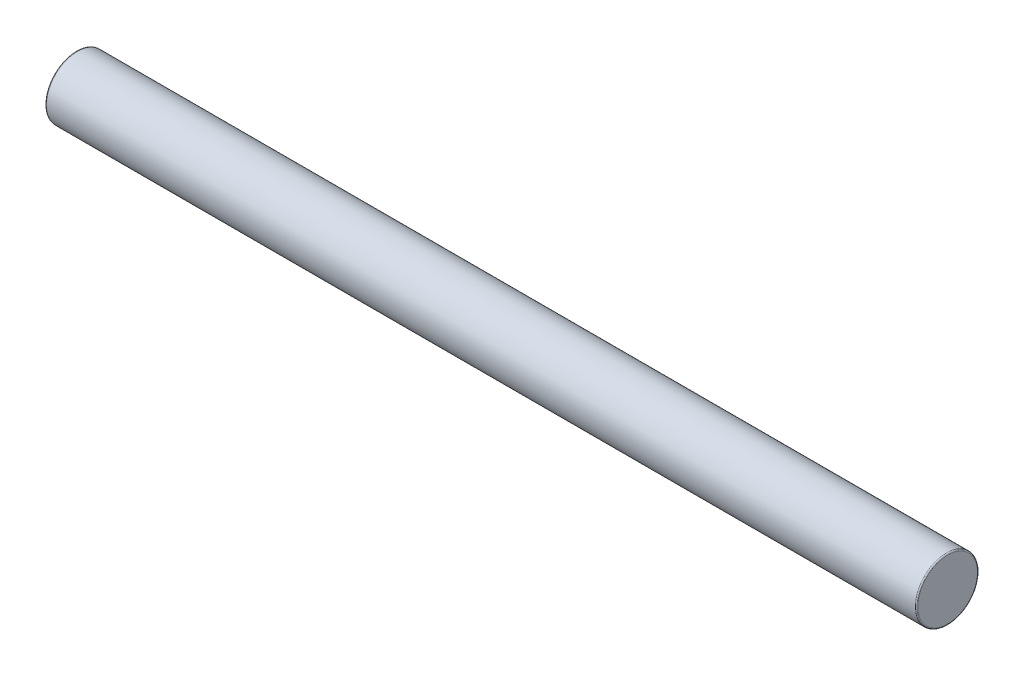
ISO-10303-21;
HEADER;
FILE_DESCRIPTION(('STEP AP214'),'2;1');
FILE_NAME('part.step','',(''),(''),'','','');
FILE_SCHEMA(('AUTOMOTIVE_DESIGN { 1 0 10303 214 1 1 1 1 }'));
ENDSEC;
DATA;
#1=APPLICATION_CONTEXT('core data for automotive mechanical design processes');
#2=APPLICATION_PROTOCOL_DEFINITION('international standard','automotive_design',2000,#1);
#3=PRODUCT_CONTEXT('',#1,'mechanical');
#4=PRODUCT('Part','Part','',(#3));
#5=PRODUCT_RELATED_PRODUCT_CATEGORY('part','',(#4));
#6=PRODUCT_DEFINITION_FORMATION('','',#4);
#7=PRODUCT_DEFINITION_CONTEXT('part definition',#1,'design');
#8=PRODUCT_DEFINITION('design','',#6,#7);
#9=PRODUCT_DEFINITION_SHAPE('','',#8);
#10=(LENGTH_UNIT() NAMED_UNIT(*) SI_UNIT(.MILLI.,.METRE.));
#11=(NAMED_UNIT(*) PLANE_ANGLE_UNIT() SI_UNIT($,.RADIAN.));
#12=(NAMED_UNIT(*) SI_UNIT($,.STERADIAN.) SOLID_ANGLE_UNIT());
#13=UNCERTAINTY_MEASURE_WITH_UNIT(LENGTH_MEASURE(1.E-05),#10,'distance_accuracy_value','');
#14=(GEOMETRIC_REPRESENTATION_CONTEXT(3) GLOBAL_UNCERTAINTY_ASSIGNED_CONTEXT((#13)) GLOBAL_UNIT_ASSIGNED_CONTEXT((#10,
#11,#12)) REPRESENTATION_CONTEXT('',''));
#15=CARTESIAN_POINT('',(0.,0.,0.));
#16=DIRECTION('',(0.,0.,1.));
#17=DIRECTION('',(1.,0.,0.));
#18=AXIS2_PLACEMENT_3D('',#15,#16,#17);
#19=CARTESIAN_POINT('',(140.,0.,0.));
#20=DIRECTION('',(-1.,0.,0.));
#21=DIRECTION('',(0.,0.,1.));
#22=AXIS2_PLACEMENT_3D('',#19,#20,#21);
#23=CYLINDRICAL_SURFACE('',#22,5.);
#24=CARTESIAN_POINT('',(0.200000000000006,0.,0.));
#25=DIRECTION('',(1.,0.,0.));
#26=DIRECTION('',(0.,0.,-1.));
#27=AXIS2_PLACEMENT_3D('',#24,#25,#26);
#28=CIRCLE('',#27,5.);
#29=CARTESIAN_POINT('',(0.200000000000006,0.,-5.));
#30=VERTEX_POINT('',#29);
#31=EDGE_CURVE('E42',#30,#30,#28,.T.);
#32=ORIENTED_EDGE('',*,*,#31,.T.);
#33=EDGE_LOOP('',(#32));
#34=FACE_BOUND('',#33,.T.);
#35=CARTESIAN_POINT('',(139.8,0.,0.));
#36=DIRECTION('',(1.,0.,0.));
#37=DIRECTION('',(0.,0.,-1.));
#38=AXIS2_PLACEMENT_3D('',#35,#36,#37);
#39=CIRCLE('',#38,5.);
#40=CARTESIAN_POINT('',(139.8,0.,-5.));
#41=VERTEX_POINT('',#40);
#42=EDGE_CURVE('E46',#41,#41,#39,.F.);
#43=ORIENTED_EDGE('',*,*,#42,.T.);
#44=EDGE_LOOP('',(#43));
#45=FACE_BOUND('',#44,.T.);
#46=ADVANCED_FACE('F31',(#34,#45),#23,.T.);
#47=CARTESIAN_POINT('',(140.,0.,0.));
#48=DIRECTION('',(1.,0.,0.));
#49=DIRECTION('',(0.,0.,-1.));
#50=AXIS2_PLACEMENT_3D('',#47,#48,#49);
#51=PLANE('',#50);
#52=CARTESIAN_POINT('',(140.,0.,0.));
#53=DIRECTION('',(1.,0.,0.));
#54=DIRECTION('',(0.,0.,-1.));
#55=AXIS2_PLACEMENT_3D('',#52,#53,#54);
#56=CIRCLE('',#55,4.8);
#57=CARTESIAN_POINT('',(140.,0.,-4.8));
#58=VERTEX_POINT('',#57);
#59=EDGE_CURVE('E10',#58,#58,#56,.T.);
#60=ORIENTED_EDGE('',*,*,#59,.T.);
#61=EDGE_LOOP('',(#60));
#62=FACE_BOUND('',#61,.T.);
#63=ADVANCED_FACE('F62',(#62),#51,.T.);
#64=CARTESIAN_POINT('',(0.,0.,0.));
#65=DIRECTION('',(1.,0.,0.));
#66=DIRECTION('',(0.,0.,-1.));
#67=AXIS2_PLACEMENT_3D('',#64,#65,#66);
#68=PLANE('',#67);
#69=CARTESIAN_POINT('',(0.,0.,0.));
#70=DIRECTION('',(1.,0.,0.));
#71=DIRECTION('',(0.,0.,-1.));
#72=AXIS2_PLACEMENT_3D('',#69,#70,#71);
#73=CIRCLE('',#72,4.8);
#74=CARTESIAN_POINT('',(0.,0.,-4.8));
#75=VERTEX_POINT('',#74);
#76=EDGE_CURVE('E38',#75,#75,#73,.F.);
#77=ORIENTED_EDGE('',*,*,#76,.T.);
#78=EDGE_LOOP('',(#77));
#79=FACE_BOUND('',#78,.T.);
#80=ADVANCED_FACE('F59',(#79),#68,.F.);
#81=CARTESIAN_POINT('',(0.200000000000006,0.,0.));
#82=DIRECTION('',(1.,0.,0.));
#83=DIRECTION('',(0.,0.,-1.));
#84=AXIS2_PLACEMENT_3D('',#81,#82,#83);
#85=TOROIDAL_SURFACE('',#84,4.8,0.2);
#86=ORIENTED_EDGE('',*,*,#76,.F.);
#87=EDGE_LOOP('',(#86));
#88=FACE_BOUND('',#87,.T.);
#89=ORIENTED_EDGE('',*,*,#31,.F.);
#90=EDGE_LOOP('',(#89));
#91=FACE_BOUND('',#90,.T.);
#92=ADVANCED_FACE('F55',(#88,#91),#85,.T.);
#93=CARTESIAN_POINT('',(139.8,0.,0.));
#94=DIRECTION('',(1.,0.,0.));
#95=DIRECTION('',(0.,0.,-1.));
#96=AXIS2_PLACEMENT_3D('',#93,#94,#95);
#97=TOROIDAL_SURFACE('',#96,4.8,0.2);
#98=ORIENTED_EDGE('',*,*,#42,.F.);
#99=EDGE_LOOP('',(#98));
#100=FACE_BOUND('',#99,.T.);
#101=ORIENTED_EDGE('',*,*,#59,.F.);
#102=EDGE_LOOP('',(#101));
#103=FACE_BOUND('',#102,.T.);
#104=ADVANCED_FACE('F33',(#100,#103),#97,.T.);
#105=CLOSED_SHELL('',(#46,#63,#80,#92,#104));
#106=MANIFOLD_SOLID_BREP('B2',#105);
#107=ADVANCED_BREP_SHAPE_REPRESENTATION('',(#18,#106),#14);
#108=SHAPE_DEFINITION_REPRESENTATION(#9,#107);
ENDSEC;
END-ISO-10303-21;
